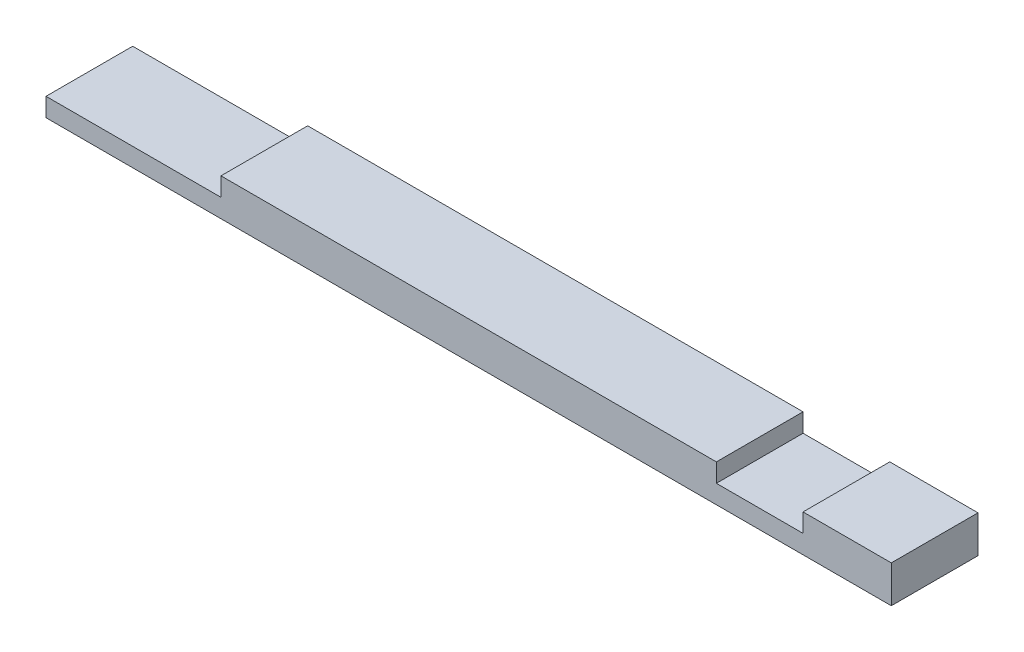
ISO-10303-21;
HEADER;
FILE_DESCRIPTION(('STEP AP214'),'2;1');
FILE_NAME('part.step','',(''),(''),'','','');
FILE_SCHEMA(('AUTOMOTIVE_DESIGN { 1 0 10303 214 1 1 1 1 }'));
ENDSEC;
DATA;
#1=APPLICATION_CONTEXT('core data for automotive mechanical design processes');
#2=APPLICATION_PROTOCOL_DEFINITION('international standard','automotive_design',2000,#1);
#3=PRODUCT_CONTEXT('',#1,'mechanical');
#4=PRODUCT('Part','Part','',(#3));
#5=PRODUCT_RELATED_PRODUCT_CATEGORY('part','',(#4));
#6=PRODUCT_DEFINITION_FORMATION('','',#4);
#7=PRODUCT_DEFINITION_CONTEXT('part definition',#1,'design');
#8=PRODUCT_DEFINITION('design','',#6,#7);
#9=PRODUCT_DEFINITION_SHAPE('','',#8);
#10=(LENGTH_UNIT() NAMED_UNIT(*) SI_UNIT(.MILLI.,.METRE.));
#11=(NAMED_UNIT(*) PLANE_ANGLE_UNIT() SI_UNIT($,.RADIAN.));
#12=(NAMED_UNIT(*) SI_UNIT($,.STERADIAN.) SOLID_ANGLE_UNIT());
#13=UNCERTAINTY_MEASURE_WITH_UNIT(LENGTH_MEASURE(1.E-05),#10,'distance_accuracy_value','');
#14=(GEOMETRIC_REPRESENTATION_CONTEXT(3) GLOBAL_UNCERTAINTY_ASSIGNED_CONTEXT((#13)) GLOBAL_UNIT_ASSIGNED_CONTEXT((#10,
#11,#12)) REPRESENTATION_CONTEXT('',''));
#15=CARTESIAN_POINT('',(0.,0.,0.));
#16=DIRECTION('',(0.,0.,1.));
#17=DIRECTION('',(1.,0.,0.));
#18=AXIS2_PLACEMENT_3D('',#15,#16,#17);
#19=CARTESIAN_POINT('',(0.,38.1,0.));
#20=DIRECTION('',(1.,0.,0.));
#21=DIRECTION('',(0.,0.,-1.));
#22=AXIS2_PLACEMENT_3D('',#19,#20,#21);
#23=PLANE('',#22);
#24=DIRECTION('',(0.,0.,1.));
#25=VECTOR('',#24,1.);
#26=CARTESIAN_POINT('',(0.,19.05,0.));
#27=LINE('',#26,#25);
#28=CARTESIAN_POINT('',(0.,19.05,-88.9));
#29=VERTEX_POINT('',#28);
#30=CARTESIAN_POINT('',(0.,19.05,0.));
#31=VERTEX_POINT('',#30);
#32=EDGE_CURVE('E179',#29,#31,#27,.T.);
#33=ORIENTED_EDGE('',*,*,#32,.F.);
#34=DIRECTION('',(0.,-1.,0.));
#35=VECTOR('',#34,1.);
#36=CARTESIAN_POINT('',(0.,38.1,-88.9));
#37=LINE('',#36,#35);
#38=CARTESIAN_POINT('',(0.,0.,-88.9));
#39=VERTEX_POINT('',#38);
#40=EDGE_CURVE('E200',#29,#39,#37,.T.);
#41=ORIENTED_EDGE('',*,*,#40,.T.);
#42=DIRECTION('',(0.,0.,1.));
#43=VECTOR('',#42,1.);
#44=CARTESIAN_POINT('',(0.,0.,0.));
#45=LINE('',#44,#43);
#46=CARTESIAN_POINT('',(0.,0.,0.));
#47=VERTEX_POINT('',#46);
#48=EDGE_CURVE('E159',#39,#47,#45,.T.);
#49=ORIENTED_EDGE('',*,*,#48,.T.);
#50=DIRECTION('',(0.,-1.,0.));
#51=VECTOR('',#50,1.);
#52=CARTESIAN_POINT('',(0.,38.1,0.));
#53=LINE('',#52,#51);
#54=EDGE_CURVE('E11',#31,#47,#53,.T.);
#55=ORIENTED_EDGE('',*,*,#54,.F.);
#56=EDGE_LOOP('',(#33,#41,#49,#55));
#57=FACE_BOUND('',#56,.T.);
#58=ADVANCED_FACE('F41',(#57),#23,.F.);
#59=CARTESIAN_POINT('',(0.,38.1,0.));
#60=DIRECTION('',(0.,-1.,0.));
#61=DIRECTION('',(0.,0.,-1.));
#62=AXIS2_PLACEMENT_3D('',#59,#60,#61);
#63=PLANE('',#62);
#64=DIRECTION('',(-1.,0.,0.));
#65=VECTOR('',#64,1.);
#66=CARTESIAN_POINT('',(0.,38.1,-88.9));
#67=LINE('',#66,#65);
#68=CARTESIAN_POINT('',(866.775,38.1,-88.9));
#69=VERTEX_POINT('',#68);
#70=CARTESIAN_POINT('',(776.28750000001,38.1,-88.9));
#71=VERTEX_POINT('',#70);
#72=EDGE_CURVE('E197',#69,#71,#67,.T.);
#73=ORIENTED_EDGE('',*,*,#72,.T.);
#74=DIRECTION('',(0.,0.,-1.));
#75=VECTOR('',#74,1.);
#76=CARTESIAN_POINT('',(776.28750000001,38.1,-4.44089209850063E-13));
#77=LINE('',#76,#75);
#78=CARTESIAN_POINT('',(776.28750000001,38.1,-4.44089209850063E-13));
#79=VERTEX_POINT('',#78);
#80=EDGE_CURVE('E122',#79,#71,#77,.T.);
#81=ORIENTED_EDGE('',*,*,#80,.F.);
#82=DIRECTION('',(1.,0.,0.));
#83=VECTOR('',#82,1.);
#84=CARTESIAN_POINT('',(0.,38.1,0.));
#85=LINE('',#84,#83);
#86=CARTESIAN_POINT('',(866.775,38.1,0.));
#87=VERTEX_POINT('',#86);
#88=EDGE_CURVE('E188',#79,#87,#85,.T.);
#89=ORIENTED_EDGE('',*,*,#88,.T.);
#90=DIRECTION('',(0.,0.,-1.));
#91=VECTOR('',#90,1.);
#92=CARTESIAN_POINT('',(866.775,38.1,0.));
#93=LINE('',#92,#91);
#94=EDGE_CURVE('E193',#87,#69,#93,.T.);
#95=ORIENTED_EDGE('',*,*,#94,.T.);
#96=EDGE_LOOP('',(#73,#81,#89,#95));
#97=FACE_BOUND('',#96,.T.);
#98=ADVANCED_FACE('F237',(#97),#63,.F.);
#99=CARTESIAN_POINT('',(0.,38.1,0.));
#100=DIRECTION('',(0.,0.,-1.));
#101=DIRECTION('',(-1.,0.,0.));
#102=AXIS2_PLACEMENT_3D('',#99,#100,#101);
#103=PLANE('',#102);
#104=ORIENTED_EDGE('',*,*,#88,.F.);
#105=DIRECTION('',(0.,1.,0.));
#106=VECTOR('',#105,1.);
#107=CARTESIAN_POINT('',(776.28750000001,19.05,-4.44089209850063E-13));
#108=LINE('',#107,#106);
#109=CARTESIAN_POINT('',(776.28750000001,19.05,-4.44089209850063E-13));
#110=VERTEX_POINT('',#109);
#111=EDGE_CURVE('E156',#110,#79,#108,.T.);
#112=ORIENTED_EDGE('',*,*,#111,.F.);
#113=DIRECTION('',(1.,0.,0.));
#114=VECTOR('',#113,1.);
#115=CARTESIAN_POINT('',(776.28750000001,19.05,-4.44089209850063E-13));
#116=LINE('',#115,#114);
#117=CARTESIAN_POINT('',(687.387500000011,19.05,-4.44089209850063E-13));
#118=VERTEX_POINT('',#117);
#119=EDGE_CURVE('E128',#118,#110,#116,.T.);
#120=ORIENTED_EDGE('',*,*,#119,.F.);
#121=DIRECTION('',(0.,1.,0.));
#122=VECTOR('',#121,1.);
#123=CARTESIAN_POINT('',(687.387500000011,19.05,-4.44089209850063E-13));
#124=LINE('',#123,#122);
#125=CARTESIAN_POINT('',(687.387500000011,38.1,-4.44089209850063E-13));
#126=VERTEX_POINT('',#125);
#127=EDGE_CURVE('E160',#118,#126,#124,.T.);
#128=ORIENTED_EDGE('',*,*,#127,.T.);
#129=CARTESIAN_POINT('',(179.400200000003,38.1,0.));
#130=VERTEX_POINT('',#129);
#131=EDGE_CURVE('E191',#130,#126,#85,.T.);
#132=ORIENTED_EDGE('',*,*,#131,.F.);
#133=DIRECTION('',(0.,1.,0.));
#134=VECTOR('',#133,1.);
#135=CARTESIAN_POINT('',(179.400200000003,19.05,0.));
#136=LINE('',#135,#134);
#137=CARTESIAN_POINT('',(179.400200000003,19.05,0.));
#138=VERTEX_POINT('',#137);
#139=EDGE_CURVE('E64',#138,#130,#136,.T.);
#140=ORIENTED_EDGE('',*,*,#139,.F.);
#141=DIRECTION('',(1.,0.,0.));
#142=VECTOR('',#141,1.);
#143=CARTESIAN_POINT('',(179.400200000003,19.05,0.));
#144=LINE('',#143,#142);
#145=EDGE_CURVE('E170',#31,#138,#144,.T.);
#146=ORIENTED_EDGE('',*,*,#145,.F.);
#147=ORIENTED_EDGE('',*,*,#54,.T.);
#148=DIRECTION('',(1.,0.,0.));
#149=VECTOR('',#148,1.);
#150=CARTESIAN_POINT('',(0.,0.,0.));
#151=LINE('',#150,#149);
#152=CARTESIAN_POINT('',(866.775,0.,0.));
#153=VERTEX_POINT('',#152);
#154=EDGE_CURVE('E204',#47,#153,#151,.T.);
#155=ORIENTED_EDGE('',*,*,#154,.T.);
#156=DIRECTION('',(0.,-1.,0.));
#157=VECTOR('',#156,1.);
#158=CARTESIAN_POINT('',(866.775,38.1,0.));
#159=LINE('',#158,#157);
#160=EDGE_CURVE('E49',#87,#153,#159,.T.);
#161=ORIENTED_EDGE('',*,*,#160,.F.);
#162=EDGE_LOOP('',(#104,#112,#120,#128,#132,#140,#146,#147,#155,#161));
#163=FACE_BOUND('',#162,.T.);
#164=ADVANCED_FACE('F238',(#163),#103,.F.);
#165=CARTESIAN_POINT('',(866.775,38.1,0.));
#166=DIRECTION('',(-1.,0.,0.));
#167=DIRECTION('',(0.,0.,1.));
#168=AXIS2_PLACEMENT_3D('',#165,#166,#167);
#169=PLANE('',#168);
#170=DIRECTION('',(0.,0.,-1.));
#171=VECTOR('',#170,1.);
#172=CARTESIAN_POINT('',(866.775,0.,0.));
#173=LINE('',#172,#171);
#174=CARTESIAN_POINT('',(866.775,0.,-88.9));
#175=VERTEX_POINT('',#174);
#176=EDGE_CURVE('E207',#153,#175,#173,.T.);
#177=ORIENTED_EDGE('',*,*,#176,.T.);
#178=DIRECTION('',(0.,-1.,0.));
#179=VECTOR('',#178,1.);
#180=CARTESIAN_POINT('',(866.775,38.1,-88.9));
#181=LINE('',#180,#179);
#182=EDGE_CURVE('E215',#69,#175,#181,.T.);
#183=ORIENTED_EDGE('',*,*,#182,.F.);
#184=ORIENTED_EDGE('',*,*,#94,.F.);
#185=ORIENTED_EDGE('',*,*,#160,.T.);
#186=EDGE_LOOP('',(#177,#183,#184,#185));
#187=FACE_BOUND('',#186,.T.);
#188=ADVANCED_FACE('F225',(#187),#169,.F.);
#189=CARTESIAN_POINT('',(0.,38.1,-88.9));
#190=DIRECTION('',(0.,0.,1.));
#191=DIRECTION('',(1.,0.,0.));
#192=AXIS2_PLACEMENT_3D('',#189,#190,#191);
#193=PLANE('',#192);
#194=DIRECTION('',(-1.,0.,0.));
#195=VECTOR('',#194,1.);
#196=CARTESIAN_POINT('',(776.28750000001,19.05,-88.9));
#197=LINE('',#196,#195);
#198=CARTESIAN_POINT('',(776.28750000001,19.05,-88.9));
#199=VERTEX_POINT('',#198);
#200=CARTESIAN_POINT('',(687.387500000011,19.05,-88.9));
#201=VERTEX_POINT('',#200);
#202=EDGE_CURVE('E134',#199,#201,#197,.T.);
#203=ORIENTED_EDGE('',*,*,#202,.F.);
#204=DIRECTION('',(0.,1.,0.));
#205=VECTOR('',#204,1.);
#206=CARTESIAN_POINT('',(776.28750000001,19.05,-88.9));
#207=LINE('',#206,#205);
#208=EDGE_CURVE('E116',#199,#71,#207,.T.);
#209=ORIENTED_EDGE('',*,*,#208,.T.);
#210=ORIENTED_EDGE('',*,*,#72,.F.);
#211=ORIENTED_EDGE('',*,*,#182,.T.);
#212=DIRECTION('',(-1.,0.,0.));
#213=VECTOR('',#212,1.);
#214=CARTESIAN_POINT('',(0.,0.,-88.9));
#215=LINE('',#214,#213);
#216=EDGE_CURVE('E192',#175,#39,#215,.T.);
#217=ORIENTED_EDGE('',*,*,#216,.T.);
#218=ORIENTED_EDGE('',*,*,#40,.F.);
#219=DIRECTION('',(-1.,0.,0.));
#220=VECTOR('',#219,1.);
#221=CARTESIAN_POINT('',(179.400200000003,19.05,-88.9));
#222=LINE('',#221,#220);
#223=CARTESIAN_POINT('',(179.400200000003,19.05,-88.9));
#224=VERTEX_POINT('',#223);
#225=EDGE_CURVE('E182',#224,#29,#222,.T.);
#226=ORIENTED_EDGE('',*,*,#225,.F.);
#227=DIRECTION('',(0.,1.,0.));
#228=VECTOR('',#227,1.);
#229=CARTESIAN_POINT('',(179.400200000003,19.05,-88.9));
#230=LINE('',#229,#228);
#231=CARTESIAN_POINT('',(179.400200000003,38.1,-88.9));
#232=VERTEX_POINT('',#231);
#233=EDGE_CURVE('E166',#224,#232,#230,.T.);
#234=ORIENTED_EDGE('',*,*,#233,.T.);
#235=CARTESIAN_POINT('',(687.38750000001,38.1,-88.9));
#236=VERTEX_POINT('',#235);
#237=EDGE_CURVE('E196',#236,#232,#67,.T.);
#238=ORIENTED_EDGE('',*,*,#237,.F.);
#239=DIRECTION('',(0.,1.,0.));
#240=VECTOR('',#239,1.);
#241=CARTESIAN_POINT('',(687.387500000011,19.05,-88.9));
#242=LINE('',#241,#240);
#243=EDGE_CURVE('E56',#201,#236,#242,.T.);
#244=ORIENTED_EDGE('',*,*,#243,.F.);
#245=EDGE_LOOP('',(#203,#209,#210,#211,#217,#218,#226,#234,#238,#244));
#246=FACE_BOUND('',#245,.T.);
#247=ADVANCED_FACE('F140',(#246),#193,.F.);
#248=ORIENTED_EDGE('',*,*,#131,.T.);
#249=DIRECTION('',(0.,0.,1.));
#250=VECTOR('',#249,1.);
#251=CARTESIAN_POINT('',(687.387500000011,38.1,-4.44089209850063E-13));
#252=LINE('',#251,#250);
#253=EDGE_CURVE('E138',#236,#126,#252,.T.);
#254=ORIENTED_EDGE('',*,*,#253,.F.);
#255=ORIENTED_EDGE('',*,*,#237,.T.);
#256=DIRECTION('',(0.,0.,-1.));
#257=VECTOR('',#256,1.);
#258=CARTESIAN_POINT('',(179.400200000003,38.1,0.));
#259=LINE('',#258,#257);
#260=EDGE_CURVE('E153',#130,#232,#259,.T.);
#261=ORIENTED_EDGE('',*,*,#260,.F.);
#262=EDGE_LOOP('',(#248,#254,#255,#261));
#263=FACE_BOUND('',#262,.T.);
#264=ADVANCED_FACE('F242',(#263),#63,.F.);
#265=CARTESIAN_POINT('',(0.,0.,0.));
#266=DIRECTION('',(0.,-1.,0.));
#267=DIRECTION('',(0.,0.,-1.));
#268=AXIS2_PLACEMENT_3D('',#265,#266,#267);
#269=PLANE('',#268);
#270=ORIENTED_EDGE('',*,*,#48,.F.);
#271=ORIENTED_EDGE('',*,*,#216,.F.);
#272=ORIENTED_EDGE('',*,*,#176,.F.);
#273=ORIENTED_EDGE('',*,*,#154,.F.);
#274=EDGE_LOOP('',(#270,#271,#272,#273));
#275=FACE_BOUND('',#274,.T.);
#276=ADVANCED_FACE('F233',(#275),#269,.T.);
#277=CARTESIAN_POINT('',(179.400200000003,19.05,0.));
#278=DIRECTION('',(1.,0.,0.));
#279=DIRECTION('',(0.,0.,-1.));
#280=AXIS2_PLACEMENT_3D('',#277,#278,#279);
#281=PLANE('',#280);
#282=ORIENTED_EDGE('',*,*,#260,.T.);
#283=ORIENTED_EDGE('',*,*,#233,.F.);
#284=DIRECTION('',(0.,0.,-1.));
#285=VECTOR('',#284,1.);
#286=CARTESIAN_POINT('',(179.400200000003,19.05,0.));
#287=LINE('',#286,#285);
#288=EDGE_CURVE('E175',#138,#224,#287,.T.);
#289=ORIENTED_EDGE('',*,*,#288,.F.);
#290=ORIENTED_EDGE('',*,*,#139,.T.);
#291=EDGE_LOOP('',(#282,#283,#289,#290));
#292=FACE_BOUND('',#291,.T.);
#293=ADVANCED_FACE('F263',(#292),#281,.F.);
#294=CARTESIAN_POINT('',(0.,19.05,0.));
#295=DIRECTION('',(0.,1.,0.));
#296=DIRECTION('',(0.,0.,1.));
#297=AXIS2_PLACEMENT_3D('',#294,#295,#296);
#298=PLANE('',#297);
#299=ORIENTED_EDGE('',*,*,#288,.T.);
#300=ORIENTED_EDGE('',*,*,#225,.T.);
#301=ORIENTED_EDGE('',*,*,#32,.T.);
#302=ORIENTED_EDGE('',*,*,#145,.T.);
#303=EDGE_LOOP('',(#299,#300,#301,#302));
#304=FACE_BOUND('',#303,.T.);
#305=ADVANCED_FACE('F265',(#304),#298,.T.);
#306=CARTESIAN_POINT('',(776.28750000001,19.05,-4.44089209850063E-13));
#307=DIRECTION('',(1.,0.,0.));
#308=DIRECTION('',(0.,0.,-1.));
#309=AXIS2_PLACEMENT_3D('',#306,#307,#308);
#310=PLANE('',#309);
#311=ORIENTED_EDGE('',*,*,#80,.T.);
#312=ORIENTED_EDGE('',*,*,#208,.F.);
#313=DIRECTION('',(0.,0.,-1.));
#314=VECTOR('',#313,1.);
#315=CARTESIAN_POINT('',(776.28750000001,19.05,-4.44089209850063E-13));
#316=LINE('',#315,#314);
#317=EDGE_CURVE('E119',#110,#199,#316,.T.);
#318=ORIENTED_EDGE('',*,*,#317,.F.);
#319=ORIENTED_EDGE('',*,*,#111,.T.);
#320=EDGE_LOOP('',(#311,#312,#318,#319));
#321=FACE_BOUND('',#320,.T.);
#322=ADVANCED_FACE('F118',(#321),#310,.F.);
#323=CARTESIAN_POINT('',(687.387500000011,19.05,-4.44089209850063E-13));
#324=DIRECTION('',(-1.,0.,0.));
#325=DIRECTION('',(0.,0.,1.));
#326=AXIS2_PLACEMENT_3D('',#323,#324,#325);
#327=PLANE('',#326);
#328=ORIENTED_EDGE('',*,*,#253,.T.);
#329=ORIENTED_EDGE('',*,*,#127,.F.);
#330=DIRECTION('',(0.,0.,1.));
#331=VECTOR('',#330,1.);
#332=CARTESIAN_POINT('',(687.387500000011,19.05,-4.44089209850063E-13));
#333=LINE('',#332,#331);
#334=EDGE_CURVE('E143',#201,#118,#333,.T.);
#335=ORIENTED_EDGE('',*,*,#334,.F.);
#336=ORIENTED_EDGE('',*,*,#243,.T.);
#337=EDGE_LOOP('',(#328,#329,#335,#336));
#338=FACE_BOUND('',#337,.T.);
#339=ADVANCED_FACE('F334',(#338),#327,.F.);
#340=CARTESIAN_POINT('',(0.,19.05,0.));
#341=DIRECTION('',(0.,1.,0.));
#342=DIRECTION('',(0.,0.,1.));
#343=AXIS2_PLACEMENT_3D('',#340,#341,#342);
#344=PLANE('',#343);
#345=ORIENTED_EDGE('',*,*,#317,.T.);
#346=ORIENTED_EDGE('',*,*,#202,.T.);
#347=ORIENTED_EDGE('',*,*,#334,.T.);
#348=ORIENTED_EDGE('',*,*,#119,.T.);
#349=EDGE_LOOP('',(#345,#346,#347,#348));
#350=FACE_BOUND('',#349,.T.);
#351=ADVANCED_FACE('F132',(#350),#344,.T.);
#352=CLOSED_SHELL('',(#58,#98,#164,#188,#247,#264,#276,#293,#305,#322,#339,#351));
#353=MANIFOLD_SOLID_BREP('B2',#352);
#354=ADVANCED_BREP_SHAPE_REPRESENTATION('',(#18,#353),#14);
#355=SHAPE_DEFINITION_REPRESENTATION(#9,#354);
ENDSEC;
END-ISO-10303-21;
